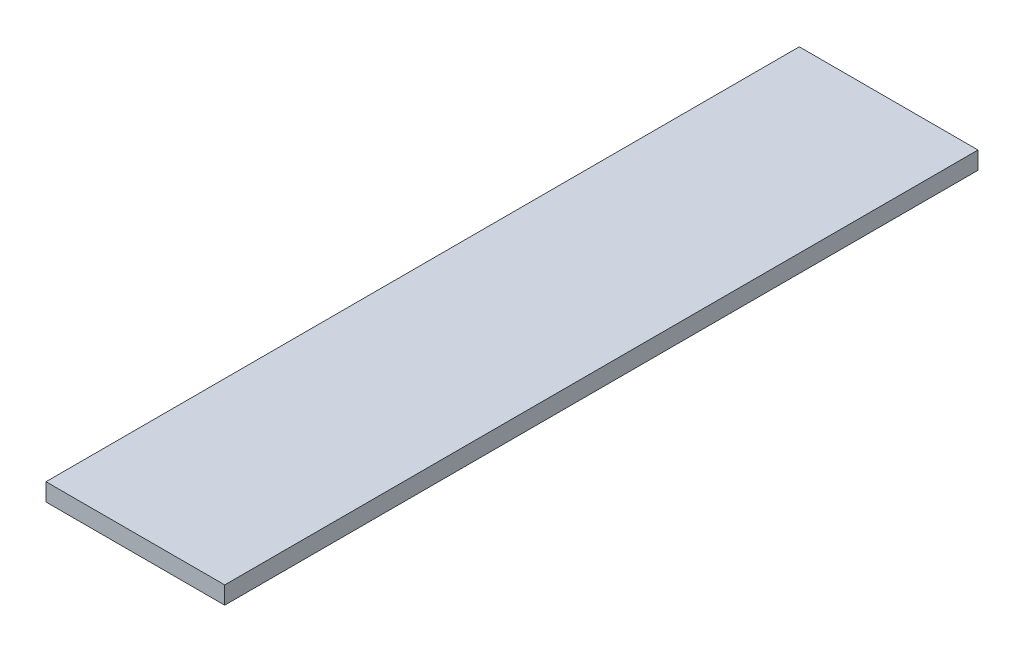
ISO-10303-21;
HEADER;
FILE_DESCRIPTION(('STEP AP214'),'2;1');
FILE_NAME('part.step','',(''),(''),'','','');
FILE_SCHEMA(('AUTOMOTIVE_DESIGN { 1 0 10303 214 1 1 1 1 }'));
ENDSEC;
DATA;
#1=APPLICATION_CONTEXT('core data for automotive mechanical design processes');
#2=APPLICATION_PROTOCOL_DEFINITION('international standard','automotive_design',2000,#1);
#3=PRODUCT_CONTEXT('',#1,'mechanical');
#4=PRODUCT('Part','Part','',(#3));
#5=PRODUCT_RELATED_PRODUCT_CATEGORY('part','',(#4));
#6=PRODUCT_DEFINITION_FORMATION('','',#4);
#7=PRODUCT_DEFINITION_CONTEXT('part definition',#1,'design');
#8=PRODUCT_DEFINITION('design','',#6,#7);
#9=PRODUCT_DEFINITION_SHAPE('','',#8);
#10=(LENGTH_UNIT() NAMED_UNIT(*) SI_UNIT(.MILLI.,.METRE.));
#11=(NAMED_UNIT(*) PLANE_ANGLE_UNIT() SI_UNIT($,.RADIAN.));
#12=(NAMED_UNIT(*) SI_UNIT($,.STERADIAN.) SOLID_ANGLE_UNIT());
#13=UNCERTAINTY_MEASURE_WITH_UNIT(LENGTH_MEASURE(1.E-05),#10,'distance_accuracy_value','');
#14=(GEOMETRIC_REPRESENTATION_CONTEXT(3) GLOBAL_UNCERTAINTY_ASSIGNED_CONTEXT((#13)) GLOBAL_UNIT_ASSIGNED_CONTEXT((#10,
#11,#12)) REPRESENTATION_CONTEXT('',''));
#15=CARTESIAN_POINT('',(0.,0.,0.));
#16=DIRECTION('',(0.,0.,1.));
#17=DIRECTION('',(1.,0.,0.));
#18=AXIS2_PLACEMENT_3D('',#15,#16,#17);
#19=CARTESIAN_POINT('',(25.4,2.5,214.122));
#20=DIRECTION('',(-1.,0.,0.));
#21=DIRECTION('',(0.,0.,1.));
#22=AXIS2_PLACEMENT_3D('',#19,#20,#21);
#23=PLANE('',#22);
#24=DIRECTION('',(0.,1.,0.));
#25=VECTOR('',#24,1.);
#26=CARTESIAN_POINT('',(25.4,2.5,0.));
#27=LINE('',#26,#25);
#28=CARTESIAN_POINT('',(25.4,-2.5,0.));
#29=VERTEX_POINT('',#28);
#30=CARTESIAN_POINT('',(25.4,2.5,0.));
#31=VERTEX_POINT('',#30);
#32=EDGE_CURVE('E95',#29,#31,#27,.T.);
#33=ORIENTED_EDGE('',*,*,#32,.T.);
#34=DIRECTION('',(0.,0.,-1.));
#35=VECTOR('',#34,1.);
#36=CARTESIAN_POINT('',(25.4,2.5,214.122));
#37=LINE('',#36,#35);
#38=CARTESIAN_POINT('',(25.4,2.5,214.122));
#39=VERTEX_POINT('',#38);
#40=EDGE_CURVE('E11',#39,#31,#37,.T.);
#41=ORIENTED_EDGE('',*,*,#40,.F.);
#42=DIRECTION('',(0.,1.,0.));
#43=VECTOR('',#42,1.);
#44=CARTESIAN_POINT('',(25.4,2.5,214.122));
#45=LINE('',#44,#43);
#46=CARTESIAN_POINT('',(25.4,-2.5,214.122));
#47=VERTEX_POINT('',#46);
#48=EDGE_CURVE('E83',#47,#39,#45,.T.);
#49=ORIENTED_EDGE('',*,*,#48,.F.);
#50=DIRECTION('',(0.,0.,-1.));
#51=VECTOR('',#50,1.);
#52=CARTESIAN_POINT('',(25.4,-2.5,214.122));
#53=LINE('',#52,#51);
#54=EDGE_CURVE('E91',#47,#29,#53,.T.);
#55=ORIENTED_EDGE('',*,*,#54,.T.);
#56=EDGE_LOOP('',(#33,#41,#49,#55));
#57=FACE_BOUND('',#56,.T.);
#58=ADVANCED_FACE('F32',(#57),#23,.F.);
#59=CARTESIAN_POINT('',(-25.4,2.5,214.122));
#60=DIRECTION('',(0.,-1.,0.));
#61=DIRECTION('',(0.,0.,-1.));
#62=AXIS2_PLACEMENT_3D('',#59,#60,#61);
#63=PLANE('',#62);
#64=DIRECTION('',(-1.,0.,0.));
#65=VECTOR('',#64,1.);
#66=CARTESIAN_POINT('',(-25.4,2.5,0.));
#67=LINE('',#66,#65);
#68=CARTESIAN_POINT('',(-25.4,2.5,0.));
#69=VERTEX_POINT('',#68);
#70=EDGE_CURVE('E87',#31,#69,#67,.T.);
#71=ORIENTED_EDGE('',*,*,#70,.T.);
#72=DIRECTION('',(0.,0.,-1.));
#73=VECTOR('',#72,1.);
#74=CARTESIAN_POINT('',(-25.4,2.5,214.122));
#75=LINE('',#74,#73);
#76=CARTESIAN_POINT('',(-25.4,2.5,214.122));
#77=VERTEX_POINT('',#76);
#78=EDGE_CURVE('E40',#77,#69,#75,.T.);
#79=ORIENTED_EDGE('',*,*,#78,.F.);
#80=DIRECTION('',(-1.,0.,0.));
#81=VECTOR('',#80,1.);
#82=CARTESIAN_POINT('',(-25.4,2.5,214.122));
#83=LINE('',#82,#81);
#84=EDGE_CURVE('E78',#39,#77,#83,.T.);
#85=ORIENTED_EDGE('',*,*,#84,.F.);
#86=ORIENTED_EDGE('',*,*,#40,.T.);
#87=EDGE_LOOP('',(#71,#79,#85,#86));
#88=FACE_BOUND('',#87,.T.);
#89=ADVANCED_FACE('F86',(#88),#63,.F.);
#90=CARTESIAN_POINT('',(-25.4,2.5,214.122));
#91=DIRECTION('',(1.,0.,0.));
#92=DIRECTION('',(0.,0.,-1.));
#93=AXIS2_PLACEMENT_3D('',#90,#91,#92);
#94=PLANE('',#93);
#95=DIRECTION('',(0.,-1.,0.));
#96=VECTOR('',#95,1.);
#97=CARTESIAN_POINT('',(-25.4,2.5,0.));
#98=LINE('',#97,#96);
#99=CARTESIAN_POINT('',(-25.4,-2.5,0.));
#100=VERTEX_POINT('',#99);
#101=EDGE_CURVE('E65',#69,#100,#98,.T.);
#102=ORIENTED_EDGE('',*,*,#101,.T.);
#103=DIRECTION('',(0.,0.,-1.));
#104=VECTOR('',#103,1.);
#105=CARTESIAN_POINT('',(-25.4,-2.5,214.122));
#106=LINE('',#105,#104);
#107=CARTESIAN_POINT('',(-25.4,-2.5,214.122));
#108=VERTEX_POINT('',#107);
#109=EDGE_CURVE('E88',#108,#100,#106,.T.);
#110=ORIENTED_EDGE('',*,*,#109,.F.);
#111=DIRECTION('',(0.,-1.,0.));
#112=VECTOR('',#111,1.);
#113=CARTESIAN_POINT('',(-25.4,2.5,214.122));
#114=LINE('',#113,#112);
#115=EDGE_CURVE('E81',#77,#108,#114,.T.);
#116=ORIENTED_EDGE('',*,*,#115,.F.);
#117=ORIENTED_EDGE('',*,*,#78,.T.);
#118=EDGE_LOOP('',(#102,#110,#116,#117));
#119=FACE_BOUND('',#118,.T.);
#120=ADVANCED_FACE('F89',(#119),#94,.F.);
#121=CARTESIAN_POINT('',(-25.4,-2.5,214.122));
#122=DIRECTION('',(0.,1.,0.));
#123=DIRECTION('',(0.,0.,1.));
#124=AXIS2_PLACEMENT_3D('',#121,#122,#123);
#125=PLANE('',#124);
#126=DIRECTION('',(1.,0.,0.));
#127=VECTOR('',#126,1.);
#128=CARTESIAN_POINT('',(-25.4,-2.5,0.));
#129=LINE('',#128,#127);
#130=EDGE_CURVE('E71',#100,#29,#129,.T.);
#131=ORIENTED_EDGE('',*,*,#130,.T.);
#132=ORIENTED_EDGE('',*,*,#54,.F.);
#133=DIRECTION('',(1.,0.,0.));
#134=VECTOR('',#133,1.);
#135=CARTESIAN_POINT('',(-25.4,-2.5,214.122));
#136=LINE('',#135,#134);
#137=EDGE_CURVE('E48',#108,#47,#136,.T.);
#138=ORIENTED_EDGE('',*,*,#137,.F.);
#139=ORIENTED_EDGE('',*,*,#109,.T.);
#140=EDGE_LOOP('',(#131,#132,#138,#139));
#141=FACE_BOUND('',#140,.T.);
#142=ADVANCED_FACE('F102',(#141),#125,.F.);
#143=CARTESIAN_POINT('',(0.,0.,214.122));
#144=DIRECTION('',(0.,0.,1.));
#145=DIRECTION('',(1.,0.,0.));
#146=AXIS2_PLACEMENT_3D('',#143,#144,#145);
#147=PLANE('',#146);
#148=ORIENTED_EDGE('',*,*,#48,.T.);
#149=ORIENTED_EDGE('',*,*,#84,.T.);
#150=ORIENTED_EDGE('',*,*,#115,.T.);
#151=ORIENTED_EDGE('',*,*,#137,.T.);
#152=EDGE_LOOP('',(#148,#149,#150,#151));
#153=FACE_BOUND('',#152,.T.);
#154=ADVANCED_FACE('F79',(#153),#147,.T.);
#155=CARTESIAN_POINT('',(0.,0.,0.));
#156=DIRECTION('',(0.,0.,1.));
#157=DIRECTION('',(1.,0.,0.));
#158=AXIS2_PLACEMENT_3D('',#155,#156,#157);
#159=PLANE('',#158);
#160=ORIENTED_EDGE('',*,*,#32,.F.);
#161=ORIENTED_EDGE('',*,*,#130,.F.);
#162=ORIENTED_EDGE('',*,*,#101,.F.);
#163=ORIENTED_EDGE('',*,*,#70,.F.);
#164=EDGE_LOOP('',(#160,#161,#162,#163));
#165=FACE_BOUND('',#164,.T.);
#166=ADVANCED_FACE('F105',(#165),#159,.F.);
#167=CLOSED_SHELL('',(#58,#89,#120,#142,#154,#166));
#168=MANIFOLD_SOLID_BREP('B2',#167);
#169=ADVANCED_BREP_SHAPE_REPRESENTATION('',(#18,#168),#14);
#170=SHAPE_DEFINITION_REPRESENTATION(#9,#169);
ENDSEC;
END-ISO-10303-21;
